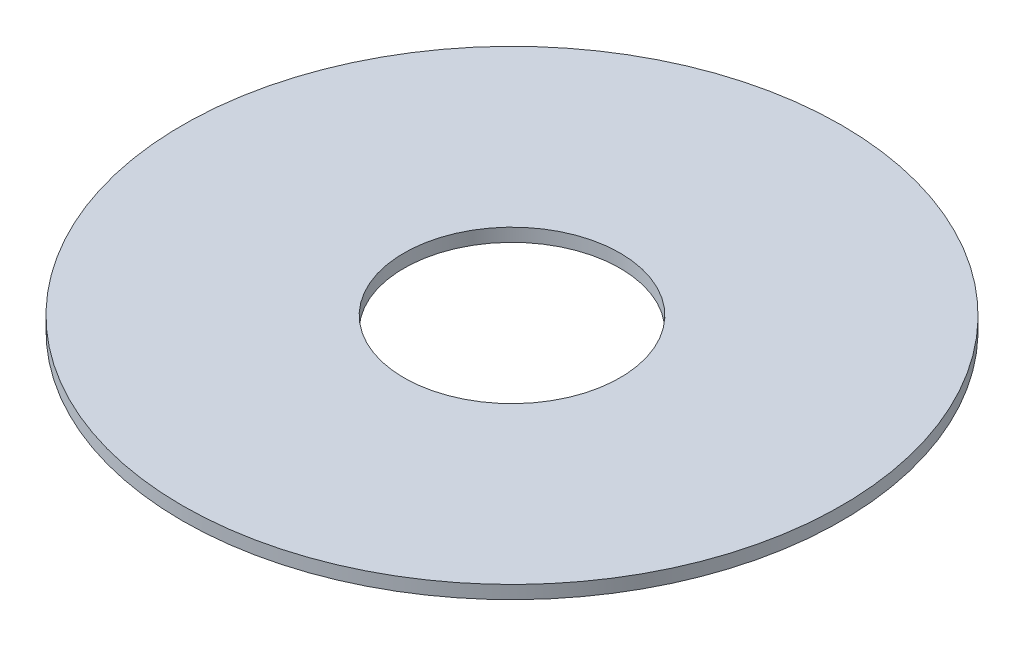
ISO-10303-21;
HEADER;
FILE_DESCRIPTION(('STEP AP214'),'2;1');
FILE_NAME('part.step','',(''),(''),'','','');
FILE_SCHEMA(('AUTOMOTIVE_DESIGN { 1 0 10303 214 1 1 1 1 }'));
ENDSEC;
DATA;
#1=APPLICATION_CONTEXT('core data for automotive mechanical design processes');
#2=APPLICATION_PROTOCOL_DEFINITION('international standard','automotive_design',2000,#1);
#3=PRODUCT_CONTEXT('',#1,'mechanical');
#4=PRODUCT('Part','Part','',(#3));
#5=PRODUCT_RELATED_PRODUCT_CATEGORY('part','',(#4));
#6=PRODUCT_DEFINITION_FORMATION('','',#4);
#7=PRODUCT_DEFINITION_CONTEXT('part definition',#1,'design');
#8=PRODUCT_DEFINITION('design','',#6,#7);
#9=PRODUCT_DEFINITION_SHAPE('','',#8);
#10=(LENGTH_UNIT() NAMED_UNIT(*) SI_UNIT(.MILLI.,.METRE.));
#11=(NAMED_UNIT(*) PLANE_ANGLE_UNIT() SI_UNIT($,.RADIAN.));
#12=(NAMED_UNIT(*) SI_UNIT($,.STERADIAN.) SOLID_ANGLE_UNIT());
#13=UNCERTAINTY_MEASURE_WITH_UNIT(LENGTH_MEASURE(1.E-05),#10,'distance_accuracy_value','');
#14=(GEOMETRIC_REPRESENTATION_CONTEXT(3) GLOBAL_UNCERTAINTY_ASSIGNED_CONTEXT((#13)) GLOBAL_UNIT_ASSIGNED_CONTEXT((#10,
#11,#12)) REPRESENTATION_CONTEXT('',''));
#15=CARTESIAN_POINT('',(0.,0.,0.));
#16=DIRECTION('',(0.,0.,1.));
#17=DIRECTION('',(1.,0.,0.));
#18=AXIS2_PLACEMENT_3D('',#15,#16,#17);
#19=CARTESIAN_POINT('',(0.,2.54,0.));
#20=DIRECTION('',(0.,1.,0.));
#21=DIRECTION('',(0.,0.,1.));
#22=AXIS2_PLACEMENT_3D('',#19,#20,#21);
#23=PLANE('',#22);
#24=CARTESIAN_POINT('',(0.,2.54,0.));
#25=DIRECTION('',(0.,1.,0.));
#26=DIRECTION('',(0.,0.,1.));
#27=AXIS2_PLACEMENT_3D('',#24,#25,#26);
#28=CIRCLE('',#27,63.5);
#29=CARTESIAN_POINT('',(0.,2.54,63.5));
#30=VERTEX_POINT('',#29);
#31=EDGE_CURVE('E10',#30,#30,#28,.T.);
#32=ORIENTED_EDGE('',*,*,#31,.T.);
#33=EDGE_LOOP('',(#32));
#34=FACE_BOUND('',#33,.T.);
#35=CARTESIAN_POINT('',(0.,2.54,0.));
#36=DIRECTION('',(0.,1.,0.));
#37=DIRECTION('',(0.,0.,1.));
#38=AXIS2_PLACEMENT_3D('',#35,#36,#37);
#39=CIRCLE('',#38,20.828);
#40=CARTESIAN_POINT('',(0.,2.54,20.828));
#41=VERTEX_POINT('',#40);
#42=EDGE_CURVE('E46',#41,#41,#39,.T.);
#43=ORIENTED_EDGE('',*,*,#42,.F.);
#44=EDGE_LOOP('',(#43));
#45=FACE_BOUND('',#44,.T.);
#46=ADVANCED_FACE('F35',(#34,#45),#23,.T.);
#47=CARTESIAN_POINT('',(0.,0.,0.));
#48=DIRECTION('',(0.,1.,0.));
#49=DIRECTION('',(0.,0.,1.));
#50=AXIS2_PLACEMENT_3D('',#47,#48,#49);
#51=PLANE('',#50);
#52=CARTESIAN_POINT('',(0.,0.,0.));
#53=DIRECTION('',(0.,1.,0.));
#54=DIRECTION('',(0.,0.,1.));
#55=AXIS2_PLACEMENT_3D('',#52,#53,#54);
#56=CIRCLE('',#55,63.5);
#57=CARTESIAN_POINT('',(0.,0.,63.5));
#58=VERTEX_POINT('',#57);
#59=EDGE_CURVE('E39',#58,#58,#56,.T.);
#60=ORIENTED_EDGE('',*,*,#59,.F.);
#61=EDGE_LOOP('',(#60));
#62=FACE_BOUND('',#61,.T.);
#63=CARTESIAN_POINT('',(0.,0.,0.));
#64=DIRECTION('',(0.,1.,0.));
#65=DIRECTION('',(0.,0.,1.));
#66=AXIS2_PLACEMENT_3D('',#63,#64,#65);
#67=CIRCLE('',#66,20.828);
#68=CARTESIAN_POINT('',(0.,0.,20.828));
#69=VERTEX_POINT('',#68);
#70=EDGE_CURVE('E48',#69,#69,#67,.T.);
#71=ORIENTED_EDGE('',*,*,#70,.T.);
#72=EDGE_LOOP('',(#71));
#73=FACE_BOUND('',#72,.T.);
#74=ADVANCED_FACE('F58',(#62,#73),#51,.F.);
#75=CARTESIAN_POINT('',(0.,2.54,0.));
#76=DIRECTION('',(0.,-1.,0.));
#77=DIRECTION('',(0.,0.,-1.));
#78=AXIS2_PLACEMENT_3D('',#75,#76,#77);
#79=CYLINDRICAL_SURFACE('',#78,63.5);
#80=ORIENTED_EDGE('',*,*,#31,.F.);
#81=EDGE_LOOP('',(#80));
#82=FACE_BOUND('',#81,.T.);
#83=ORIENTED_EDGE('',*,*,#59,.T.);
#84=EDGE_LOOP('',(#83));
#85=FACE_BOUND('',#84,.T.);
#86=ADVANCED_FACE('F37',(#82,#85),#79,.T.);
#87=CARTESIAN_POINT('',(0.,2.54,0.));
#88=DIRECTION('',(0.,-1.,0.));
#89=DIRECTION('',(0.,0.,-1.));
#90=AXIS2_PLACEMENT_3D('',#87,#88,#89);
#91=CYLINDRICAL_SURFACE('',#90,20.828);
#92=ORIENTED_EDGE('',*,*,#42,.T.);
#93=EDGE_LOOP('',(#92));
#94=FACE_BOUND('',#93,.T.);
#95=ORIENTED_EDGE('',*,*,#70,.F.);
#96=EDGE_LOOP('',(#95));
#97=FACE_BOUND('',#96,.T.);
#98=ADVANCED_FACE('F54',(#94,#97),#91,.F.);
#99=CLOSED_SHELL('',(#46,#74,#86,#98));
#100=MANIFOLD_SOLID_BREP('B2',#99);
#101=ADVANCED_BREP_SHAPE_REPRESENTATION('',(#18,#100),#14);
#102=SHAPE_DEFINITION_REPRESENTATION(#9,#101);
ENDSEC;
END-ISO-10303-21;
